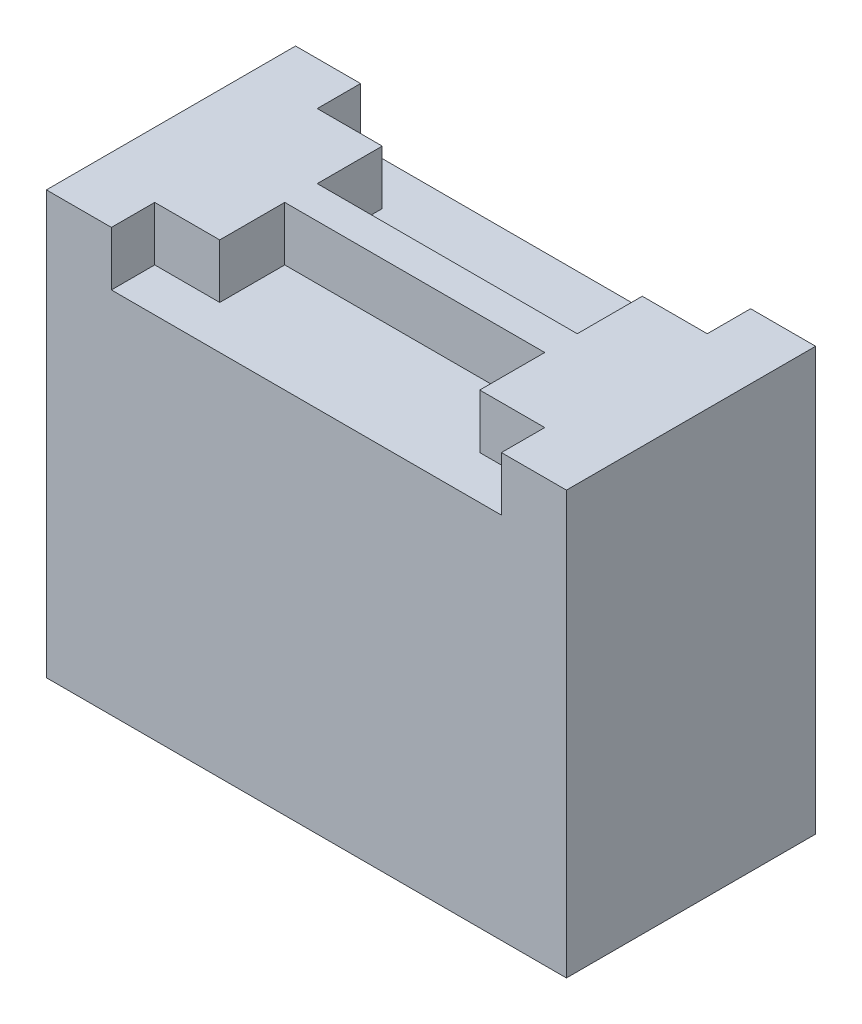
ISO-10303-21;
HEADER;
FILE_DESCRIPTION(('STEP AP214'),'2;1');
FILE_NAME('part.step','',(''),(''),'','','');
FILE_SCHEMA(('AUTOMOTIVE_DESIGN { 1 0 10303 214 1 1 1 1 }'));
ENDSEC;
DATA;
#1=APPLICATION_CONTEXT('core data for automotive mechanical design processes');
#2=APPLICATION_PROTOCOL_DEFINITION('international standard','automotive_design',2000,#1);
#3=PRODUCT_CONTEXT('',#1,'mechanical');
#4=PRODUCT('Part','Part','',(#3));
#5=PRODUCT_RELATED_PRODUCT_CATEGORY('part','',(#4));
#6=PRODUCT_DEFINITION_FORMATION('','',#4);
#7=PRODUCT_DEFINITION_CONTEXT('part definition',#1,'design');
#8=PRODUCT_DEFINITION('design','',#6,#7);
#9=PRODUCT_DEFINITION_SHAPE('','',#8);
#10=(LENGTH_UNIT() NAMED_UNIT(*) SI_UNIT(.MILLI.,.METRE.));
#11=(NAMED_UNIT(*) PLANE_ANGLE_UNIT() SI_UNIT($,.RADIAN.));
#12=(NAMED_UNIT(*) SI_UNIT($,.STERADIAN.) SOLID_ANGLE_UNIT());
#13=UNCERTAINTY_MEASURE_WITH_UNIT(LENGTH_MEASURE(1.E-05),#10,'distance_accuracy_value','');
#14=(GEOMETRIC_REPRESENTATION_CONTEXT(3) GLOBAL_UNCERTAINTY_ASSIGNED_CONTEXT((#13)) GLOBAL_UNIT_ASSIGNED_CONTEXT((#10,
#11,#12)) REPRESENTATION_CONTEXT('',''));
#15=CARTESIAN_POINT('',(0.,0.,0.));
#16=DIRECTION('',(0.,0.,1.));
#17=DIRECTION('',(1.,0.,0.));
#18=AXIS2_PLACEMENT_3D('',#15,#16,#17);
#19=CARTESIAN_POINT('',(-120.,97.5,57.5));
#20=DIRECTION('',(0.,-1.,0.));
#21=DIRECTION('',(0.,0.,-1.));
#22=AXIS2_PLACEMENT_3D('',#19,#20,#21);
#23=PLANE('',#22);
#24=DIRECTION('',(0.,0.,-1.));
#25=VECTOR('',#24,1.);
#26=CARTESIAN_POINT('',(90.,97.5,450.666730694498));
#27=LINE('',#26,#25);
#28=CARTESIAN_POINT('',(90.,97.5,57.5));
#29=VERTEX_POINT('',#28);
#30=CARTESIAN_POINT('',(90.,97.5,37.5));
#31=VERTEX_POINT('',#30);
#32=EDGE_CURVE('E264',#29,#31,#27,.T.);
#33=ORIENTED_EDGE('',*,*,#32,.F.);
#34=DIRECTION('',(-1.,0.,0.));
#35=VECTOR('',#34,1.);
#36=CARTESIAN_POINT('',(-120.,97.5,57.5));
#37=LINE('',#36,#35);
#38=CARTESIAN_POINT('',(120.,97.5,57.5));
#39=VERTEX_POINT('',#38);
#40=EDGE_CURVE('E320',#39,#29,#37,.T.);
#41=ORIENTED_EDGE('',*,*,#40,.F.);
#42=DIRECTION('',(0.,0.,-1.));
#43=VECTOR('',#42,1.);
#44=CARTESIAN_POINT('',(120.,97.5,57.5));
#45=LINE('',#44,#43);
#46=CARTESIAN_POINT('',(120.,97.5,-57.5));
#47=VERTEX_POINT('',#46);
#48=EDGE_CURVE('E11',#39,#47,#45,.T.);
#49=ORIENTED_EDGE('',*,*,#48,.T.);
#50=DIRECTION('',(-1.,0.,0.));
#51=VECTOR('',#50,1.);
#52=CARTESIAN_POINT('',(-120.,97.5,-57.5));
#53=LINE('',#52,#51);
#54=CARTESIAN_POINT('',(90.,97.5,-57.5));
#55=VERTEX_POINT('',#54);
#56=EDGE_CURVE('E252',#47,#55,#53,.T.);
#57=ORIENTED_EDGE('',*,*,#56,.T.);
#58=DIRECTION('',(0.,0.,1.));
#59=VECTOR('',#58,1.);
#60=CARTESIAN_POINT('',(90.,97.5,-450.666730694498));
#61=LINE('',#60,#59);
#62=CARTESIAN_POINT('',(90.,97.5,-37.5));
#63=VERTEX_POINT('',#62);
#64=EDGE_CURVE('E185',#55,#63,#61,.T.);
#65=ORIENTED_EDGE('',*,*,#64,.T.);
#66=DIRECTION('',(-1.,0.,0.));
#67=VECTOR('',#66,1.);
#68=CARTESIAN_POINT('',(-120.,97.5,-37.5));
#69=LINE('',#68,#67);
#70=CARTESIAN_POINT('',(59.9999999999999,97.5,-37.5));
#71=VERTEX_POINT('',#70);
#72=EDGE_CURVE('E205',#63,#71,#69,.T.);
#73=ORIENTED_EDGE('',*,*,#72,.T.);
#74=DIRECTION('',(0.,0.,1.));
#75=VECTOR('',#74,1.);
#76=CARTESIAN_POINT('',(60.,97.5,-522.541730694498));
#77=LINE('',#76,#75);
#78=CARTESIAN_POINT('',(60.,97.5,-7.5));
#79=VERTEX_POINT('',#78);
#80=EDGE_CURVE('E240',#71,#79,#77,.T.);
#81=ORIENTED_EDGE('',*,*,#80,.T.);
#82=DIRECTION('',(-1.,0.,0.));
#83=VECTOR('',#82,1.);
#84=CARTESIAN_POINT('',(-120.,97.5,-7.5));
#85=LINE('',#84,#83);
#86=CARTESIAN_POINT('',(-60.,97.5,-7.5));
#87=VERTEX_POINT('',#86);
#88=EDGE_CURVE('E195',#79,#87,#85,.T.);
#89=ORIENTED_EDGE('',*,*,#88,.T.);
#90=DIRECTION('',(0.,0.,1.));
#91=VECTOR('',#90,1.);
#92=CARTESIAN_POINT('',(-60.,97.4999999999999,-522.541730694498));
#93=LINE('',#92,#91);
#94=CARTESIAN_POINT('',(-60.,97.5,-37.5));
#95=VERTEX_POINT('',#94);
#96=EDGE_CURVE('E230',#95,#87,#93,.T.);
#97=ORIENTED_EDGE('',*,*,#96,.F.);
#98=DIRECTION('',(-1.,0.,0.));
#99=VECTOR('',#98,1.);
#100=CARTESIAN_POINT('',(-120.,97.5,-37.5));
#101=LINE('',#100,#99);
#102=CARTESIAN_POINT('',(-90.,97.5,-37.5));
#103=VERTEX_POINT('',#102);
#104=EDGE_CURVE('E219',#95,#103,#101,.T.);
#105=ORIENTED_EDGE('',*,*,#104,.T.);
#106=DIRECTION('',(0.,0.,1.));
#107=VECTOR('',#106,1.);
#108=CARTESIAN_POINT('',(-90.,97.5,-450.666730694498));
#109=LINE('',#108,#107);
#110=CARTESIAN_POINT('',(-90.,97.5,-57.5));
#111=VERTEX_POINT('',#110);
#112=EDGE_CURVE('E214',#111,#103,#109,.T.);
#113=ORIENTED_EDGE('',*,*,#112,.F.);
#114=CARTESIAN_POINT('',(-120.,97.5,-57.5));
#115=VERTEX_POINT('',#114);
#116=EDGE_CURVE('E251',#111,#115,#53,.T.);
#117=ORIENTED_EDGE('',*,*,#116,.T.);
#118=DIRECTION('',(0.,0.,-1.));
#119=VECTOR('',#118,1.);
#120=CARTESIAN_POINT('',(-120.,97.5,57.5));
#121=LINE('',#120,#119);
#122=CARTESIAN_POINT('',(-120.,97.5,57.5));
#123=VERTEX_POINT('',#122);
#124=EDGE_CURVE('E43',#123,#115,#121,.T.);
#125=ORIENTED_EDGE('',*,*,#124,.F.);
#126=CARTESIAN_POINT('',(-90.,97.5,57.5));
#127=VERTEX_POINT('',#126);
#128=EDGE_CURVE('E319',#127,#123,#37,.T.);
#129=ORIENTED_EDGE('',*,*,#128,.F.);
#130=DIRECTION('',(0.,0.,-1.));
#131=VECTOR('',#130,1.);
#132=CARTESIAN_POINT('',(-90.,97.5,450.666730694498));
#133=LINE('',#132,#131);
#134=CARTESIAN_POINT('',(-90.,97.5,37.5));
#135=VERTEX_POINT('',#134);
#136=EDGE_CURVE('E58',#127,#135,#133,.T.);
#137=ORIENTED_EDGE('',*,*,#136,.T.);
#138=DIRECTION('',(-1.,0.,0.));
#139=VECTOR('',#138,1.);
#140=CARTESIAN_POINT('',(-120.,97.5,37.5));
#141=LINE('',#140,#139);
#142=CARTESIAN_POINT('',(-60.,97.5,37.5));
#143=VERTEX_POINT('',#142);
#144=EDGE_CURVE('E286',#143,#135,#141,.T.);
#145=ORIENTED_EDGE('',*,*,#144,.F.);
#146=DIRECTION('',(0.,0.,-1.));
#147=VECTOR('',#146,1.);
#148=CARTESIAN_POINT('',(-60.,97.4999999999999,522.541730694498));
#149=LINE('',#148,#147);
#150=CARTESIAN_POINT('',(-60.,97.5,7.5));
#151=VERTEX_POINT('',#150);
#152=EDGE_CURVE('E298',#143,#151,#149,.T.);
#153=ORIENTED_EDGE('',*,*,#152,.T.);
#154=DIRECTION('',(-1.,0.,0.));
#155=VECTOR('',#154,1.);
#156=CARTESIAN_POINT('',(-120.,97.5,7.5));
#157=LINE('',#156,#155);
#158=CARTESIAN_POINT('',(60.,97.5,7.5));
#159=VERTEX_POINT('',#158);
#160=EDGE_CURVE('E291',#159,#151,#157,.T.);
#161=ORIENTED_EDGE('',*,*,#160,.F.);
#162=DIRECTION('',(0.,0.,-1.));
#163=VECTOR('',#162,1.);
#164=CARTESIAN_POINT('',(60.,97.5,522.541730694498));
#165=LINE('',#164,#163);
#166=CARTESIAN_POINT('',(59.9999999999999,97.5,37.5));
#167=VERTEX_POINT('',#166);
#168=EDGE_CURVE('E310',#167,#159,#165,.T.);
#169=ORIENTED_EDGE('',*,*,#168,.F.);
#170=DIRECTION('',(-1.,0.,0.));
#171=VECTOR('',#170,1.);
#172=CARTESIAN_POINT('',(-120.,97.5,37.5));
#173=LINE('',#172,#171);
#174=EDGE_CURVE('E260',#31,#167,#173,.T.);
#175=ORIENTED_EDGE('',*,*,#174,.F.);
#176=EDGE_LOOP('',(#33,#41,#49,#57,#65,#73,#81,#89,#97,#105,#113,#117,#125,#129,#137,#145,#153,
#161,#169,#175));
#177=FACE_BOUND('',#176,.T.);
#178=ADVANCED_FACE('F35',(#177),#23,.F.);
#179=CARTESIAN_POINT('',(0.,0.,57.5));
#180=DIRECTION('',(0.,0.,-1.));
#181=DIRECTION('',(-1.,0.,0.));
#182=AXIS2_PLACEMENT_3D('',#179,#180,#181);
#183=PLANE('',#182);
#184=DIRECTION('',(0.,-1.,0.));
#185=VECTOR('',#184,1.);
#186=CARTESIAN_POINT('',(90.,72.5,57.5));
#187=LINE('',#186,#185);
#188=CARTESIAN_POINT('',(90.,72.5,57.5));
#189=VERTEX_POINT('',#188);
#190=EDGE_CURVE('E266',#29,#189,#187,.T.);
#191=ORIENTED_EDGE('',*,*,#190,.T.);
#192=DIRECTION('',(-1.,0.,0.));
#193=VECTOR('',#192,1.);
#194=CARTESIAN_POINT('',(-60.,72.5,57.5));
#195=LINE('',#194,#193);
#196=CARTESIAN_POINT('',(-90.,72.5,57.5));
#197=VERTEX_POINT('',#196);
#198=EDGE_CURVE('E303',#189,#197,#195,.T.);
#199=ORIENTED_EDGE('',*,*,#198,.T.);
#200=DIRECTION('',(0.,-1.,0.));
#201=VECTOR('',#200,1.);
#202=CARTESIAN_POINT('',(-90.,72.5,57.5));
#203=LINE('',#202,#201);
#204=EDGE_CURVE('E283',#127,#197,#203,.T.);
#205=ORIENTED_EDGE('',*,*,#204,.F.);
#206=ORIENTED_EDGE('',*,*,#128,.T.);
#207=DIRECTION('',(0.,-1.,0.));
#208=VECTOR('',#207,1.);
#209=CARTESIAN_POINT('',(-120.,-97.5,57.5));
#210=LINE('',#209,#208);
#211=CARTESIAN_POINT('',(-120.,-97.5,57.5));
#212=VERTEX_POINT('',#211);
#213=EDGE_CURVE('E323',#123,#212,#210,.T.);
#214=ORIENTED_EDGE('',*,*,#213,.T.);
#215=DIRECTION('',(1.,0.,0.));
#216=VECTOR('',#215,1.);
#217=CARTESIAN_POINT('',(-120.,-97.5,57.5));
#218=LINE('',#217,#216);
#219=CARTESIAN_POINT('',(120.,-97.5,57.5));
#220=VERTEX_POINT('',#219);
#221=EDGE_CURVE('E325',#212,#220,#218,.T.);
#222=ORIENTED_EDGE('',*,*,#221,.T.);
#223=DIRECTION('',(0.,1.,0.));
#224=VECTOR('',#223,1.);
#225=CARTESIAN_POINT('',(120.,-97.5,57.5));
#226=LINE('',#225,#224);
#227=EDGE_CURVE('E314',#220,#39,#226,.T.);
#228=ORIENTED_EDGE('',*,*,#227,.T.);
#229=ORIENTED_EDGE('',*,*,#40,.T.);
#230=EDGE_LOOP('',(#191,#199,#205,#206,#214,#222,#228,#229));
#231=FACE_BOUND('',#230,.T.);
#232=ADVANCED_FACE('F368',(#231),#183,.F.);
#233=CARTESIAN_POINT('',(120.,-97.5,57.5));
#234=DIRECTION('',(-1.,0.,0.));
#235=DIRECTION('',(0.,0.,1.));
#236=AXIS2_PLACEMENT_3D('',#233,#234,#235);
#237=PLANE('',#236);
#238=DIRECTION('',(0.,0.,-1.));
#239=VECTOR('',#238,1.);
#240=CARTESIAN_POINT('',(120.,-97.5,57.5));
#241=LINE('',#240,#239);
#242=CARTESIAN_POINT('',(120.,-97.5,-57.5));
#243=VERTEX_POINT('',#242);
#244=EDGE_CURVE('E327',#220,#243,#241,.T.);
#245=ORIENTED_EDGE('',*,*,#244,.T.);
#246=DIRECTION('',(0.,1.,0.));
#247=VECTOR('',#246,1.);
#248=CARTESIAN_POINT('',(120.,-97.5,-57.5));
#249=LINE('',#248,#247);
#250=EDGE_CURVE('E246',#243,#47,#249,.T.);
#251=ORIENTED_EDGE('',*,*,#250,.T.);
#252=ORIENTED_EDGE('',*,*,#48,.F.);
#253=ORIENTED_EDGE('',*,*,#227,.F.);
#254=EDGE_LOOP('',(#245,#251,#252,#253));
#255=FACE_BOUND('',#254,.T.);
#256=ADVANCED_FACE('F37',(#255),#237,.F.);
#257=CARTESIAN_POINT('',(-120.,-97.5,57.5));
#258=DIRECTION('',(1.,0.,0.));
#259=DIRECTION('',(0.,0.,-1.));
#260=AXIS2_PLACEMENT_3D('',#257,#258,#259);
#261=PLANE('',#260);
#262=ORIENTED_EDGE('',*,*,#124,.T.);
#263=DIRECTION('',(0.,-1.,0.));
#264=VECTOR('',#263,1.);
#265=CARTESIAN_POINT('',(-120.,-97.5,-57.5));
#266=LINE('',#265,#264);
#267=CARTESIAN_POINT('',(-120.,-97.5,-57.5));
#268=VERTEX_POINT('',#267);
#269=EDGE_CURVE('E254',#115,#268,#266,.T.);
#270=ORIENTED_EDGE('',*,*,#269,.T.);
#271=DIRECTION('',(0.,0.,-1.));
#272=VECTOR('',#271,1.);
#273=CARTESIAN_POINT('',(-120.,-97.5,57.5));
#274=LINE('',#273,#272);
#275=EDGE_CURVE('E329',#212,#268,#274,.T.);
#276=ORIENTED_EDGE('',*,*,#275,.F.);
#277=ORIENTED_EDGE('',*,*,#213,.F.);
#278=EDGE_LOOP('',(#262,#270,#276,#277));
#279=FACE_BOUND('',#278,.T.);
#280=ADVANCED_FACE('F334',(#279),#261,.F.);
#281=CARTESIAN_POINT('',(-120.,-97.5,57.5));
#282=DIRECTION('',(0.,1.,0.));
#283=DIRECTION('',(0.,0.,1.));
#284=AXIS2_PLACEMENT_3D('',#281,#282,#283);
#285=PLANE('',#284);
#286=ORIENTED_EDGE('',*,*,#275,.T.);
#287=DIRECTION('',(1.,0.,0.));
#288=VECTOR('',#287,1.);
#289=CARTESIAN_POINT('',(-120.,-97.5,-57.5));
#290=LINE('',#289,#288);
#291=EDGE_CURVE('E257',#268,#243,#290,.T.);
#292=ORIENTED_EDGE('',*,*,#291,.T.);
#293=ORIENTED_EDGE('',*,*,#244,.F.);
#294=ORIENTED_EDGE('',*,*,#221,.F.);
#295=EDGE_LOOP('',(#286,#292,#293,#294));
#296=FACE_BOUND('',#295,.T.);
#297=ADVANCED_FACE('F366',(#296),#285,.F.);
#298=CARTESIAN_POINT('',(60.,72.5,522.541730694498));
#299=DIRECTION('',(-1.,0.,0.));
#300=DIRECTION('',(0.,-1.,0.));
#301=AXIS2_PLACEMENT_3D('',#298,#299,#300);
#302=PLANE('',#301);
#303=DIRECTION('',(0.,-1.,0.));
#304=VECTOR('',#303,1.);
#305=CARTESIAN_POINT('',(60.,72.5,37.5));
#306=LINE('',#305,#304);
#307=CARTESIAN_POINT('',(60.,72.5,37.5));
#308=VERTEX_POINT('',#307);
#309=EDGE_CURVE('E269',#167,#308,#306,.T.);
#310=ORIENTED_EDGE('',*,*,#309,.F.);
#311=ORIENTED_EDGE('',*,*,#168,.T.);
#312=DIRECTION('',(0.,-1.,0.));
#313=VECTOR('',#312,1.);
#314=CARTESIAN_POINT('',(60.,72.5,7.49999999999995));
#315=LINE('',#314,#313);
#316=CARTESIAN_POINT('',(60.,72.5,7.49999999999998));
#317=VERTEX_POINT('',#316);
#318=EDGE_CURVE('E295',#159,#317,#315,.T.);
#319=ORIENTED_EDGE('',*,*,#318,.T.);
#320=DIRECTION('',(0.,0.,-1.));
#321=VECTOR('',#320,1.);
#322=CARTESIAN_POINT('',(60.,72.5,522.541730694498));
#323=LINE('',#322,#321);
#324=EDGE_CURVE('E312',#308,#317,#323,.T.);
#325=ORIENTED_EDGE('',*,*,#324,.F.);
#326=EDGE_LOOP('',(#310,#311,#319,#325));
#327=FACE_BOUND('',#326,.T.);
#328=ADVANCED_FACE('F389',(#327),#302,.T.);
#329=CARTESIAN_POINT('',(-60.,72.5,522.541730694498));
#330=DIRECTION('',(0.,1.,0.));
#331=DIRECTION('',(0.,0.,1.));
#332=AXIS2_PLACEMENT_3D('',#329,#330,#331);
#333=PLANE('',#332);
#334=ORIENTED_EDGE('',*,*,#198,.F.);
#335=DIRECTION('',(0.,0.,-1.));
#336=VECTOR('',#335,1.);
#337=CARTESIAN_POINT('',(90.,72.5,450.666730694498));
#338=LINE('',#337,#336);
#339=CARTESIAN_POINT('',(90.,72.5,37.5));
#340=VERTEX_POINT('',#339);
#341=EDGE_CURVE('E272',#189,#340,#338,.T.);
#342=ORIENTED_EDGE('',*,*,#341,.T.);
#343=DIRECTION('',(-1.,0.,0.));
#344=VECTOR('',#343,1.);
#345=CARTESIAN_POINT('',(60.,72.5,37.5));
#346=LINE('',#345,#344);
#347=EDGE_CURVE('E50',#340,#308,#346,.T.);
#348=ORIENTED_EDGE('',*,*,#347,.T.);
#349=ORIENTED_EDGE('',*,*,#324,.T.);
#350=DIRECTION('',(-1.,0.,0.));
#351=VECTOR('',#350,1.);
#352=CARTESIAN_POINT('',(-60.,72.5,7.49999999999995));
#353=LINE('',#352,#351);
#354=CARTESIAN_POINT('',(-60.,72.5,7.49999999999998));
#355=VERTEX_POINT('',#354);
#356=EDGE_CURVE('E299',#317,#355,#353,.T.);
#357=ORIENTED_EDGE('',*,*,#356,.T.);
#358=DIRECTION('',(0.,0.,-1.));
#359=VECTOR('',#358,1.);
#360=CARTESIAN_POINT('',(-60.,72.5,522.541730694498));
#361=LINE('',#360,#359);
#362=CARTESIAN_POINT('',(-60.,72.5,37.5));
#363=VERTEX_POINT('',#362);
#364=EDGE_CURVE('E308',#363,#355,#361,.T.);
#365=ORIENTED_EDGE('',*,*,#364,.F.);
#366=DIRECTION('',(1.,0.,0.));
#367=VECTOR('',#366,1.);
#368=CARTESIAN_POINT('',(-60.,72.5,37.5));
#369=LINE('',#368,#367);
#370=CARTESIAN_POINT('',(-90.,72.5,37.5));
#371=VERTEX_POINT('',#370);
#372=EDGE_CURVE('E280',#371,#363,#369,.T.);
#373=ORIENTED_EDGE('',*,*,#372,.F.);
#374=DIRECTION('',(0.,0.,-1.));
#375=VECTOR('',#374,1.);
#376=CARTESIAN_POINT('',(-90.,72.5,450.666730694498));
#377=LINE('',#376,#375);
#378=EDGE_CURVE('E288',#197,#371,#377,.T.);
#379=ORIENTED_EDGE('',*,*,#378,.F.);
#380=EDGE_LOOP('',(#334,#342,#348,#349,#357,#365,#373,#379));
#381=FACE_BOUND('',#380,.T.);
#382=ADVANCED_FACE('F385',(#381),#333,.T.);
#383=CARTESIAN_POINT('',(-60.,97.4999999999999,522.541730694498));
#384=DIRECTION('',(1.,0.,0.));
#385=DIRECTION('',(0.,1.,0.));
#386=AXIS2_PLACEMENT_3D('',#383,#384,#385);
#387=PLANE('',#386);
#388=DIRECTION('',(0.,1.,0.));
#389=VECTOR('',#388,1.);
#390=CARTESIAN_POINT('',(-60.,97.4999999999999,37.5));
#391=LINE('',#390,#389);
#392=EDGE_CURVE('E274',#363,#143,#391,.T.);
#393=ORIENTED_EDGE('',*,*,#392,.F.);
#394=ORIENTED_EDGE('',*,*,#364,.T.);
#395=DIRECTION('',(0.,1.,0.));
#396=VECTOR('',#395,1.);
#397=CARTESIAN_POINT('',(-60.,97.4999999999999,7.49999999999995));
#398=LINE('',#397,#396);
#399=EDGE_CURVE('E300',#355,#151,#398,.T.);
#400=ORIENTED_EDGE('',*,*,#399,.T.);
#401=ORIENTED_EDGE('',*,*,#152,.F.);
#402=EDGE_LOOP('',(#393,#394,#400,#401));
#403=FACE_BOUND('',#402,.T.);
#404=ADVANCED_FACE('F383',(#403),#387,.T.);
#405=CARTESIAN_POINT('',(0.,0.,7.5));
#406=DIRECTION('',(0.,0.,-1.));
#407=DIRECTION('',(-1.,0.,0.));
#408=AXIS2_PLACEMENT_3D('',#405,#406,#407);
#409=PLANE('',#408);
#410=ORIENTED_EDGE('',*,*,#160,.T.);
#411=ORIENTED_EDGE('',*,*,#399,.F.);
#412=ORIENTED_EDGE('',*,*,#356,.F.);
#413=ORIENTED_EDGE('',*,*,#318,.F.);
#414=EDGE_LOOP('',(#410,#411,#412,#413));
#415=FACE_BOUND('',#414,.T.);
#416=ADVANCED_FACE('F381',(#415),#409,.F.);
#417=CARTESIAN_POINT('',(-90.,72.5,450.666730694498));
#418=DIRECTION('',(-1.,0.,0.));
#419=DIRECTION('',(0.,0.,1.));
#420=AXIS2_PLACEMENT_3D('',#417,#418,#419);
#421=PLANE('',#420);
#422=ORIENTED_EDGE('',*,*,#204,.T.);
#423=ORIENTED_EDGE('',*,*,#378,.T.);
#424=DIRECTION('',(0.,-1.,0.));
#425=VECTOR('',#424,1.);
#426=CARTESIAN_POINT('',(-90.,72.5,37.5));
#427=LINE('',#426,#425);
#428=EDGE_CURVE('E277',#135,#371,#427,.T.);
#429=ORIENTED_EDGE('',*,*,#428,.F.);
#430=ORIENTED_EDGE('',*,*,#136,.F.);
#431=EDGE_LOOP('',(#422,#423,#429,#430));
#432=FACE_BOUND('',#431,.T.);
#433=ADVANCED_FACE('F371',(#432),#421,.F.);
#434=CARTESIAN_POINT('',(0.,0.,37.5));
#435=DIRECTION('',(0.,0.,-1.));
#436=DIRECTION('',(-1.,0.,0.));
#437=AXIS2_PLACEMENT_3D('',#434,#435,#436);
#438=PLANE('',#437);
#439=ORIENTED_EDGE('',*,*,#372,.T.);
#440=ORIENTED_EDGE('',*,*,#392,.T.);
#441=ORIENTED_EDGE('',*,*,#144,.T.);
#442=ORIENTED_EDGE('',*,*,#428,.T.);
#443=EDGE_LOOP('',(#439,#440,#441,#442));
#444=FACE_BOUND('',#443,.T.);
#445=ADVANCED_FACE('F374',(#444),#438,.F.);
#446=CARTESIAN_POINT('',(90.,72.5,450.666730694498));
#447=DIRECTION('',(-1.,0.,0.));
#448=DIRECTION('',(0.,0.,1.));
#449=AXIS2_PLACEMENT_3D('',#446,#447,#448);
#450=PLANE('',#449);
#451=ORIENTED_EDGE('',*,*,#190,.F.);
#452=ORIENTED_EDGE('',*,*,#32,.T.);
#453=DIRECTION('',(0.,-1.,0.));
#454=VECTOR('',#453,1.);
#455=CARTESIAN_POINT('',(90.,72.5,37.5));
#456=LINE('',#455,#454);
#457=EDGE_CURVE('E261',#31,#340,#456,.T.);
#458=ORIENTED_EDGE('',*,*,#457,.T.);
#459=ORIENTED_EDGE('',*,*,#341,.F.);
#460=EDGE_LOOP('',(#451,#452,#458,#459));
#461=FACE_BOUND('',#460,.T.);
#462=ADVANCED_FACE('F395',(#461),#450,.T.);
#463=CARTESIAN_POINT('',(0.,0.,37.5));
#464=DIRECTION('',(0.,0.,-1.));
#465=DIRECTION('',(-1.,0.,0.));
#466=AXIS2_PLACEMENT_3D('',#463,#464,#465);
#467=PLANE('',#466);
#468=ORIENTED_EDGE('',*,*,#309,.T.);
#469=ORIENTED_EDGE('',*,*,#347,.F.);
#470=ORIENTED_EDGE('',*,*,#457,.F.);
#471=ORIENTED_EDGE('',*,*,#174,.T.);
#472=EDGE_LOOP('',(#468,#469,#470,#471));
#473=FACE_BOUND('',#472,.T.);
#474=ADVANCED_FACE('F392',(#473),#467,.F.);
#475=CARTESIAN_POINT('',(0.,0.,-57.5));
#476=DIRECTION('',(0.,0.,1.));
#477=DIRECTION('',(-1.,0.,0.));
#478=AXIS2_PLACEMENT_3D('',#475,#476,#477);
#479=PLANE('',#478);
#480=DIRECTION('',(0.,-1.,0.));
#481=VECTOR('',#480,1.);
#482=CARTESIAN_POINT('',(90.,72.5,-57.5));
#483=LINE('',#482,#481);
#484=CARTESIAN_POINT('',(90.,72.5,-57.5));
#485=VERTEX_POINT('',#484);
#486=EDGE_CURVE('E190',#55,#485,#483,.T.);
#487=ORIENTED_EDGE('',*,*,#486,.F.);
#488=ORIENTED_EDGE('',*,*,#56,.F.);
#489=ORIENTED_EDGE('',*,*,#250,.F.);
#490=ORIENTED_EDGE('',*,*,#291,.F.);
#491=ORIENTED_EDGE('',*,*,#269,.F.);
#492=ORIENTED_EDGE('',*,*,#116,.F.);
#493=DIRECTION('',(0.,-1.,0.));
#494=VECTOR('',#493,1.);
#495=CARTESIAN_POINT('',(-90.,72.5,-57.5));
#496=LINE('',#495,#494);
#497=CARTESIAN_POINT('',(-90.,72.5,-57.5));
#498=VERTEX_POINT('',#497);
#499=EDGE_CURVE('E193',#111,#498,#496,.T.);
#500=ORIENTED_EDGE('',*,*,#499,.T.);
#501=DIRECTION('',(-1.,0.,0.));
#502=VECTOR('',#501,1.);
#503=CARTESIAN_POINT('',(-60.,72.5,-57.5));
#504=LINE('',#503,#502);
#505=EDGE_CURVE('E178',#485,#498,#504,.T.);
#506=ORIENTED_EDGE('',*,*,#505,.F.);
#507=EDGE_LOOP('',(#487,#488,#489,#490,#491,#492,#500,#506));
#508=FACE_BOUND('',#507,.T.);
#509=ADVANCED_FACE('F188',(#508),#479,.F.);
#510=CARTESIAN_POINT('',(60.,72.5,-522.541730694498));
#511=DIRECTION('',(-1.,0.,0.));
#512=DIRECTION('',(0.,-1.,0.));
#513=AXIS2_PLACEMENT_3D('',#510,#511,#512);
#514=PLANE('',#513);
#515=DIRECTION('',(0.,-1.,0.));
#516=VECTOR('',#515,1.);
#517=CARTESIAN_POINT('',(60.,72.5,-37.5));
#518=LINE('',#517,#516);
#519=CARTESIAN_POINT('',(60.,72.5,-37.5));
#520=VERTEX_POINT('',#519);
#521=EDGE_CURVE('E200',#71,#520,#518,.T.);
#522=ORIENTED_EDGE('',*,*,#521,.T.);
#523=DIRECTION('',(0.,0.,1.));
#524=VECTOR('',#523,1.);
#525=CARTESIAN_POINT('',(60.,72.5,-522.541730694498));
#526=LINE('',#525,#524);
#527=CARTESIAN_POINT('',(60.,72.5,-7.49999999999998));
#528=VERTEX_POINT('',#527);
#529=EDGE_CURVE('E243',#520,#528,#526,.T.);
#530=ORIENTED_EDGE('',*,*,#529,.T.);
#531=DIRECTION('',(0.,-1.,0.));
#532=VECTOR('',#531,1.);
#533=CARTESIAN_POINT('',(60.,72.5,-7.49999999999995));
#534=LINE('',#533,#532);
#535=EDGE_CURVE('E227',#79,#528,#534,.T.);
#536=ORIENTED_EDGE('',*,*,#535,.F.);
#537=ORIENTED_EDGE('',*,*,#80,.F.);
#538=EDGE_LOOP('',(#522,#530,#536,#537));
#539=FACE_BOUND('',#538,.T.);
#540=ADVANCED_FACE('F356',(#539),#514,.T.);
#541=CARTESIAN_POINT('',(-60.,72.5,-522.541730694498));
#542=DIRECTION('',(0.,1.,0.));
#543=DIRECTION('',(0.,0.,-1.));
#544=AXIS2_PLACEMENT_3D('',#541,#542,#543);
#545=PLANE('',#544);
#546=ORIENTED_EDGE('',*,*,#505,.T.);
#547=DIRECTION('',(0.,0.,1.));
#548=VECTOR('',#547,1.);
#549=CARTESIAN_POINT('',(-90.,72.5,-450.666730694498));
#550=LINE('',#549,#548);
#551=CARTESIAN_POINT('',(-90.,72.5,-37.5));
#552=VERTEX_POINT('',#551);
#553=EDGE_CURVE('E222',#498,#552,#550,.T.);
#554=ORIENTED_EDGE('',*,*,#553,.T.);
#555=DIRECTION('',(1.,0.,0.));
#556=VECTOR('',#555,1.);
#557=CARTESIAN_POINT('',(-60.,72.5,-37.5));
#558=LINE('',#557,#556);
#559=CARTESIAN_POINT('',(-60.,72.5,-37.5));
#560=VERTEX_POINT('',#559);
#561=EDGE_CURVE('E215',#552,#560,#558,.T.);
#562=ORIENTED_EDGE('',*,*,#561,.T.);
#563=DIRECTION('',(0.,0.,1.));
#564=VECTOR('',#563,1.);
#565=CARTESIAN_POINT('',(-60.,72.5,-522.541730694498));
#566=LINE('',#565,#564);
#567=CARTESIAN_POINT('',(-60.,72.5,-7.49999999999998));
#568=VERTEX_POINT('',#567);
#569=EDGE_CURVE('E237',#560,#568,#566,.T.);
#570=ORIENTED_EDGE('',*,*,#569,.T.);
#571=DIRECTION('',(-1.,0.,0.));
#572=VECTOR('',#571,1.);
#573=CARTESIAN_POINT('',(-60.,72.5,-7.49999999999995));
#574=LINE('',#573,#572);
#575=EDGE_CURVE('E231',#528,#568,#574,.T.);
#576=ORIENTED_EDGE('',*,*,#575,.F.);
#577=ORIENTED_EDGE('',*,*,#529,.F.);
#578=DIRECTION('',(-1.,0.,0.));
#579=VECTOR('',#578,1.);
#580=CARTESIAN_POINT('',(60.,72.5,-37.5));
#581=LINE('',#580,#579);
#582=CARTESIAN_POINT('',(90.,72.5,-37.5));
#583=VERTEX_POINT('',#582);
#584=EDGE_CURVE('E181',#583,#520,#581,.T.);
#585=ORIENTED_EDGE('',*,*,#584,.F.);
#586=DIRECTION('',(0.,0.,1.));
#587=VECTOR('',#586,1.);
#588=CARTESIAN_POINT('',(90.,72.5,-450.666730694498));
#589=LINE('',#588,#587);
#590=EDGE_CURVE('E174',#485,#583,#589,.T.);
#591=ORIENTED_EDGE('',*,*,#590,.F.);
#592=EDGE_LOOP('',(#546,#554,#562,#570,#576,#577,#585,#591));
#593=FACE_BOUND('',#592,.T.);
#594=ADVANCED_FACE('F176',(#593),#545,.T.);
#595=CARTESIAN_POINT('',(-60.,97.4999999999999,-522.541730694498));
#596=DIRECTION('',(1.,0.,0.));
#597=DIRECTION('',(0.,1.,0.));
#598=AXIS2_PLACEMENT_3D('',#595,#596,#597);
#599=PLANE('',#598);
#600=DIRECTION('',(0.,1.,0.));
#601=VECTOR('',#600,1.);
#602=CARTESIAN_POINT('',(-60.,97.4999999999999,-37.5));
#603=LINE('',#602,#601);
#604=EDGE_CURVE('E184',#560,#95,#603,.T.);
#605=ORIENTED_EDGE('',*,*,#604,.T.);
#606=ORIENTED_EDGE('',*,*,#96,.T.);
#607=DIRECTION('',(0.,1.,0.));
#608=VECTOR('',#607,1.);
#609=CARTESIAN_POINT('',(-60.,97.4999999999999,-7.49999999999995));
#610=LINE('',#609,#608);
#611=EDGE_CURVE('E194',#568,#87,#610,.T.);
#612=ORIENTED_EDGE('',*,*,#611,.F.);
#613=ORIENTED_EDGE('',*,*,#569,.F.);
#614=EDGE_LOOP('',(#605,#606,#612,#613));
#615=FACE_BOUND('',#614,.T.);
#616=ADVANCED_FACE('F350',(#615),#599,.T.);
#617=CARTESIAN_POINT('',(0.,0.,-7.5));
#618=DIRECTION('',(0.,0.,1.));
#619=DIRECTION('',(-1.,0.,0.));
#620=AXIS2_PLACEMENT_3D('',#617,#618,#619);
#621=PLANE('',#620);
#622=ORIENTED_EDGE('',*,*,#88,.F.);
#623=ORIENTED_EDGE('',*,*,#535,.T.);
#624=ORIENTED_EDGE('',*,*,#575,.T.);
#625=ORIENTED_EDGE('',*,*,#611,.T.);
#626=EDGE_LOOP('',(#622,#623,#624,#625));
#627=FACE_BOUND('',#626,.T.);
#628=ADVANCED_FACE('F353',(#627),#621,.F.);
#629=CARTESIAN_POINT('',(-90.,72.5,-450.666730694498));
#630=DIRECTION('',(-1.,0.,0.));
#631=DIRECTION('',(0.,0.,-1.));
#632=AXIS2_PLACEMENT_3D('',#629,#630,#631);
#633=PLANE('',#632);
#634=ORIENTED_EDGE('',*,*,#499,.F.);
#635=ORIENTED_EDGE('',*,*,#112,.T.);
#636=DIRECTION('',(0.,-1.,0.));
#637=VECTOR('',#636,1.);
#638=CARTESIAN_POINT('',(-90.,72.5,-37.5));
#639=LINE('',#638,#637);
#640=EDGE_CURVE('E212',#103,#552,#639,.T.);
#641=ORIENTED_EDGE('',*,*,#640,.T.);
#642=ORIENTED_EDGE('',*,*,#553,.F.);
#643=EDGE_LOOP('',(#634,#635,#641,#642));
#644=FACE_BOUND('',#643,.T.);
#645=ADVANCED_FACE('F344',(#644),#633,.F.);
#646=CARTESIAN_POINT('',(0.,0.,-37.5));
#647=DIRECTION('',(0.,0.,1.));
#648=DIRECTION('',(-1.,0.,0.));
#649=AXIS2_PLACEMENT_3D('',#646,#647,#648);
#650=PLANE('',#649);
#651=ORIENTED_EDGE('',*,*,#561,.F.);
#652=ORIENTED_EDGE('',*,*,#640,.F.);
#653=ORIENTED_EDGE('',*,*,#104,.F.);
#654=ORIENTED_EDGE('',*,*,#604,.F.);
#655=EDGE_LOOP('',(#651,#652,#653,#654));
#656=FACE_BOUND('',#655,.T.);
#657=ADVANCED_FACE('F348',(#656),#650,.F.);
#658=CARTESIAN_POINT('',(90.,72.5,-450.666730694498));
#659=DIRECTION('',(-1.,0.,0.));
#660=DIRECTION('',(0.,0.,-1.));
#661=AXIS2_PLACEMENT_3D('',#658,#659,#660);
#662=PLANE('',#661);
#663=ORIENTED_EDGE('',*,*,#486,.T.);
#664=ORIENTED_EDGE('',*,*,#590,.T.);
#665=DIRECTION('',(0.,-1.,0.));
#666=VECTOR('',#665,1.);
#667=CARTESIAN_POINT('',(90.,72.5,-37.5));
#668=LINE('',#667,#666);
#669=EDGE_CURVE('E202',#63,#583,#668,.T.);
#670=ORIENTED_EDGE('',*,*,#669,.F.);
#671=ORIENTED_EDGE('',*,*,#64,.F.);
#672=EDGE_LOOP('',(#663,#664,#670,#671));
#673=FACE_BOUND('',#672,.T.);
#674=ADVANCED_FACE('F198',(#673),#662,.T.);
#675=CARTESIAN_POINT('',(0.,0.,-37.5));
#676=DIRECTION('',(0.,0.,1.));
#677=DIRECTION('',(-1.,0.,0.));
#678=AXIS2_PLACEMENT_3D('',#675,#676,#677);
#679=PLANE('',#678);
#680=ORIENTED_EDGE('',*,*,#521,.F.);
#681=ORIENTED_EDGE('',*,*,#72,.F.);
#682=ORIENTED_EDGE('',*,*,#669,.T.);
#683=ORIENTED_EDGE('',*,*,#584,.T.);
#684=EDGE_LOOP('',(#680,#681,#682,#683));
#685=FACE_BOUND('',#684,.T.);
#686=ADVANCED_FACE('F359',(#685),#679,.F.);
#687=CLOSED_SHELL('',(#178,#232,#256,#280,#297,#328,#382,#404,#416,#433,#445,#462,#474,#509,
#540,#594,#616,#628,#645,#657,#674,#686));
#688=MANIFOLD_SOLID_BREP('B2',#687);
#689=ADVANCED_BREP_SHAPE_REPRESENTATION('',(#18,#688),#14);
#690=SHAPE_DEFINITION_REPRESENTATION(#9,#689);
ENDSEC;
END-ISO-10303-21;
